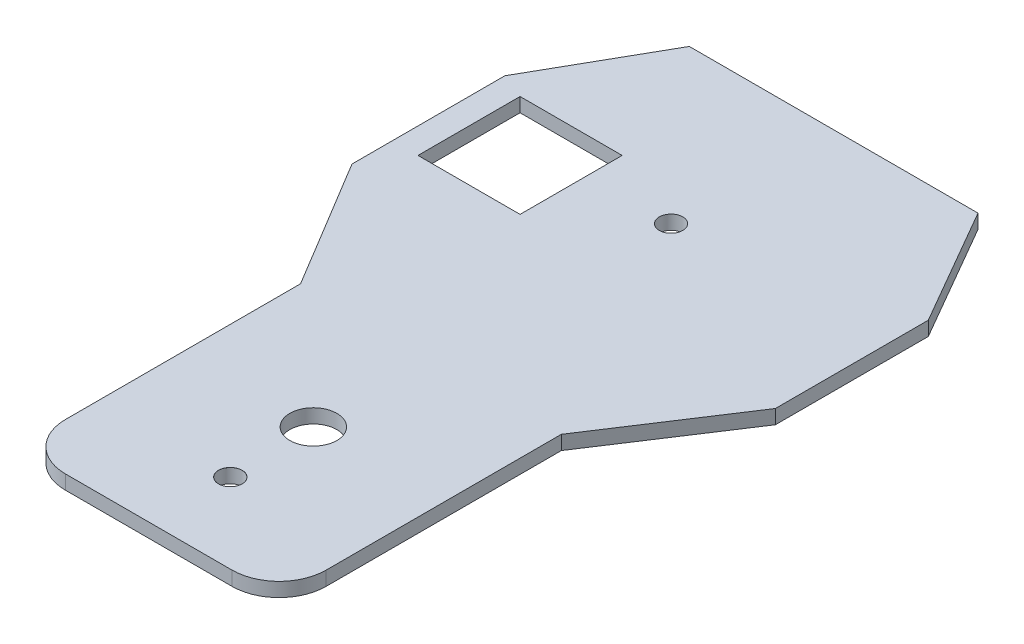
ISO-10303-21;
HEADER;
FILE_DESCRIPTION(('STEP AP214'),'2;1');
FILE_NAME('part.step','',(''),(''),'','','');
FILE_SCHEMA(('AUTOMOTIVE_DESIGN { 1 0 10303 214 1 1 1 1 }'));
ENDSEC;
DATA;
#1=APPLICATION_CONTEXT('core data for automotive mechanical design processes');
#2=APPLICATION_PROTOCOL_DEFINITION('international standard','automotive_design',2000,#1);
#3=PRODUCT_CONTEXT('',#1,'mechanical');
#4=PRODUCT('Part','Part','',(#3));
#5=PRODUCT_RELATED_PRODUCT_CATEGORY('part','',(#4));
#6=PRODUCT_DEFINITION_FORMATION('','',#4);
#7=PRODUCT_DEFINITION_CONTEXT('part definition',#1,'design');
#8=PRODUCT_DEFINITION('design','',#6,#7);
#9=PRODUCT_DEFINITION_SHAPE('','',#8);
#10=(LENGTH_UNIT() NAMED_UNIT(*) SI_UNIT(.MILLI.,.METRE.));
#11=(NAMED_UNIT(*) PLANE_ANGLE_UNIT() SI_UNIT($,.RADIAN.));
#12=(NAMED_UNIT(*) SI_UNIT($,.STERADIAN.) SOLID_ANGLE_UNIT());
#13=UNCERTAINTY_MEASURE_WITH_UNIT(LENGTH_MEASURE(1.E-05),#10,'distance_accuracy_value','');
#14=(GEOMETRIC_REPRESENTATION_CONTEXT(3) GLOBAL_UNCERTAINTY_ASSIGNED_CONTEXT((#13)) GLOBAL_UNIT_ASSIGNED_CONTEXT((#10,
#11,#12)) REPRESENTATION_CONTEXT('',''));
#15=CARTESIAN_POINT('',(0.,0.,0.));
#16=DIRECTION('',(0.,0.,1.));
#17=DIRECTION('',(1.,0.,0.));
#18=AXIS2_PLACEMENT_3D('',#15,#16,#17);
#19=CARTESIAN_POINT('',(113.507776729368,-94.9367989636439,-162.936798963645));
#20=DIRECTION('',(-0.86602540378444,0.,0.499999999999999));
#21=DIRECTION('',(0.499999999999998,0.,0.86602540378444));
#22=AXIS2_PLACEMENT_3D('',#19,#20,#21);
#23=PLANE('',#22);
#24=DIRECTION('',(-0.499999999999998,0.,-0.86602540378444));
#25=VECTOR('',#24,1.);
#26=CARTESIAN_POINT('',(113.507776729368,-100.936798963644,-162.936798963645));
#27=LINE('',#26,#25);
#28=CARTESIAN_POINT('',(142.37529018885,-100.936798963644,-112.936798963645));
#29=VERTEX_POINT('',#28);
#30=CARTESIAN_POINT('',(113.507776729368,-100.936798963644,-162.936798963645));
#31=VERTEX_POINT('',#30);
#32=EDGE_CURVE('E183',#29,#31,#27,.T.);
#33=ORIENTED_EDGE('',*,*,#32,.T.);
#34=DIRECTION('',(0.,-1.,0.));
#35=VECTOR('',#34,1.);
#36=CARTESIAN_POINT('',(113.507776729368,-94.9367989636439,-162.936798963645));
#37=LINE('',#36,#35);
#38=CARTESIAN_POINT('',(113.507776729368,-94.9367989636439,-162.936798963645));
#39=VERTEX_POINT('',#38);
#40=EDGE_CURVE('E203',#39,#31,#37,.T.);
#41=ORIENTED_EDGE('',*,*,#40,.F.);
#42=DIRECTION('',(-0.499999999999998,0.,-0.86602540378444));
#43=VECTOR('',#42,1.);
#44=CARTESIAN_POINT('',(113.507776729368,-94.9367989636439,-162.936798963645));
#45=LINE('',#44,#43);
#46=CARTESIAN_POINT('',(142.37529018885,-94.9367989636443,-112.936798963645));
#47=VERTEX_POINT('',#46);
#48=EDGE_CURVE('E230',#47,#39,#45,.T.);
#49=ORIENTED_EDGE('',*,*,#48,.F.);
#50=DIRECTION('',(0.,-1.,0.));
#51=VECTOR('',#50,1.);
#52=CARTESIAN_POINT('',(142.37529018885,-94.9367989636443,-112.936798963645));
#53=LINE('',#52,#51);
#54=EDGE_CURVE('E224',#47,#29,#53,.T.);
#55=ORIENTED_EDGE('',*,*,#54,.T.);
#56=EDGE_LOOP('',(#33,#41,#49,#55));
#57=FACE_BOUND('',#56,.T.);
#58=ADVANCED_FACE('F38',(#57),#23,.F.);
#59=CARTESIAN_POINT('',(-9.21949599790414,-94.9367989636439,-162.936798963645));
#60=DIRECTION('',(0.,0.,1.));
#61=DIRECTION('',(0.,-1.,0.));
#62=AXIS2_PLACEMENT_3D('',#59,#60,#61);
#63=PLANE('',#62);
#64=DIRECTION('',(-1.,0.,0.));
#65=VECTOR('',#64,1.);
#66=CARTESIAN_POINT('',(-9.21949599790414,-100.936798963644,-162.936798963645));
#67=LINE('',#66,#65);
#68=CARTESIAN_POINT('',(-9.21949599790414,-100.936798963644,-162.936798963645));
#69=VERTEX_POINT('',#68);
#70=EDGE_CURVE('E246',#31,#69,#67,.T.);
#71=ORIENTED_EDGE('',*,*,#70,.T.);
#72=DIRECTION('',(0.,-1.,0.));
#73=VECTOR('',#72,1.);
#74=CARTESIAN_POINT('',(-9.21949599790414,-94.9367989636439,-162.936798963645));
#75=LINE('',#74,#73);
#76=CARTESIAN_POINT('',(-9.21949599790414,-94.9367989636439,-162.936798963645));
#77=VERTEX_POINT('',#76);
#78=EDGE_CURVE('E206',#77,#69,#75,.T.);
#79=ORIENTED_EDGE('',*,*,#78,.F.);
#80=DIRECTION('',(-1.,0.,0.));
#81=VECTOR('',#80,1.);
#82=CARTESIAN_POINT('',(-9.21949599790414,-94.9367989636439,-162.936798963645));
#83=LINE('',#82,#81);
#84=EDGE_CURVE('E266',#39,#77,#83,.T.);
#85=ORIENTED_EDGE('',*,*,#84,.F.);
#86=ORIENTED_EDGE('',*,*,#40,.T.);
#87=EDGE_LOOP('',(#71,#79,#85,#86));
#88=FACE_BOUND('',#87,.T.);
#89=ADVANCED_FACE('F323',(#88),#63,.F.);
#90=CARTESIAN_POINT('',(-9.21949599790414,-94.9367989636439,-162.936798963645));
#91=DIRECTION('',(0.86948551479421,0.,0.493958439104999));
#92=DIRECTION('',(0.493958439104999,0.,-0.86948551479421));
#93=AXIS2_PLACEMENT_3D('',#90,#91,#92);
#94=PLANE('',#93);
#95=DIRECTION('',(-0.493958439104999,0.,0.86948551479421));
#96=VECTOR('',#95,1.);
#97=CARTESIAN_POINT('',(-9.21949599790414,-100.936798963644,-162.936798963645));
#98=LINE('',#97,#96);
#99=CARTESIAN_POINT('',(-37.6247098111503,-100.936798963644,-112.936798963645));
#100=VERTEX_POINT('',#99);
#101=EDGE_CURVE('E244',#69,#100,#98,.T.);
#102=ORIENTED_EDGE('',*,*,#101,.T.);
#103=DIRECTION('',(0.,-1.,0.));
#104=VECTOR('',#103,1.);
#105=CARTESIAN_POINT('',(-37.6247098111503,-94.9367989636443,-112.936798963645));
#106=LINE('',#105,#104);
#107=CARTESIAN_POINT('',(-37.6247098111503,-94.9367989636443,-112.936798963645));
#108=VERTEX_POINT('',#107);
#109=EDGE_CURVE('E209',#108,#100,#106,.T.);
#110=ORIENTED_EDGE('',*,*,#109,.F.);
#111=DIRECTION('',(-0.493958439104999,0.,0.86948551479421));
#112=VECTOR('',#111,1.);
#113=CARTESIAN_POINT('',(-9.21949599790414,-94.9367989636439,-162.936798963645));
#114=LINE('',#113,#112);
#115=EDGE_CURVE('E264',#77,#108,#114,.T.);
#116=ORIENTED_EDGE('',*,*,#115,.F.);
#117=ORIENTED_EDGE('',*,*,#78,.T.);
#118=EDGE_LOOP('',(#102,#110,#116,#117));
#119=FACE_BOUND('',#118,.T.);
#120=ADVANCED_FACE('F329',(#119),#94,.F.);
#121=CARTESIAN_POINT('',(-37.6247098111503,-94.9367989636443,-112.936798963645));
#122=DIRECTION('',(1.,0.,0.));
#123=DIRECTION('',(0.,0.,-1.));
#124=AXIS2_PLACEMENT_3D('',#121,#122,#123);
#125=PLANE('',#124);
#126=DIRECTION('',(0.,0.,1.));
#127=VECTOR('',#126,1.);
#128=CARTESIAN_POINT('',(-37.6247098111503,-100.936798963644,-112.936798963645));
#129=LINE('',#128,#127);
#130=CARTESIAN_POINT('',(-37.6247098111503,-100.936798963645,-47.9367989636454));
#131=VERTEX_POINT('',#130);
#132=EDGE_CURVE('E242',#100,#131,#129,.T.);
#133=ORIENTED_EDGE('',*,*,#132,.T.);
#134=DIRECTION('',(0.,-1.,0.));
#135=VECTOR('',#134,1.);
#136=CARTESIAN_POINT('',(-37.6247098111503,-94.936798963645,-47.9367989636454));
#137=LINE('',#136,#135);
#138=CARTESIAN_POINT('',(-37.6247098111503,-94.936798963645,-47.9367989636454));
#139=VERTEX_POINT('',#138);
#140=EDGE_CURVE('E212',#139,#131,#137,.T.);
#141=ORIENTED_EDGE('',*,*,#140,.F.);
#142=DIRECTION('',(0.,0.,1.));
#143=VECTOR('',#142,1.);
#144=CARTESIAN_POINT('',(-37.6247098111503,-94.9367989636443,-112.936798963645));
#145=LINE('',#144,#143);
#146=EDGE_CURVE('E262',#108,#139,#145,.T.);
#147=ORIENTED_EDGE('',*,*,#146,.F.);
#148=ORIENTED_EDGE('',*,*,#109,.T.);
#149=EDGE_LOOP('',(#133,#141,#147,#148));
#150=FACE_BOUND('',#149,.T.);
#151=ADVANCED_FACE('F373',(#150),#125,.F.);
#152=CARTESIAN_POINT('',(-37.6247098111503,-94.936798963645,-47.9367989636454));
#153=DIRECTION('',(0.856483287792819,0.,-0.516174755031282));
#154=DIRECTION('',(-0.516174755031282,0.,-0.856483287792819));
#155=AXIS2_PLACEMENT_3D('',#152,#153,#154);
#156=PLANE('',#155);
#157=DIRECTION('',(0.516174755031281,0.,0.856483287792819));
#158=VECTOR('',#157,1.);
#159=CARTESIAN_POINT('',(-37.6247098111503,-100.936798963645,-47.9367989636454));
#160=LINE('',#159,#158);
#161=CARTESIAN_POINT('',(-4.47799004282734,-100.936798963646,7.06320103635456));
#162=VERTEX_POINT('',#161);
#163=EDGE_CURVE('E240',#131,#162,#160,.T.);
#164=ORIENTED_EDGE('',*,*,#163,.T.);
#165=DIRECTION('',(0.,-1.,0.));
#166=VECTOR('',#165,1.);
#167=CARTESIAN_POINT('',(-4.47799004282734,-94.9367989636456,7.06320103635463));
#168=LINE('',#167,#166);
#169=CARTESIAN_POINT('',(-4.47799004282734,-94.9367989636456,7.06320103635463));
#170=VERTEX_POINT('',#169);
#171=EDGE_CURVE('E215',#170,#162,#168,.T.);
#172=ORIENTED_EDGE('',*,*,#171,.F.);
#173=DIRECTION('',(0.516174755031281,0.,0.856483287792819));
#174=VECTOR('',#173,1.);
#175=CARTESIAN_POINT('',(-37.6247098111503,-94.936798963645,-47.9367989636454));
#176=LINE('',#175,#174);
#177=EDGE_CURVE('E260',#139,#170,#176,.T.);
#178=ORIENTED_EDGE('',*,*,#177,.F.);
#179=ORIENTED_EDGE('',*,*,#140,.T.);
#180=EDGE_LOOP('',(#164,#172,#178,#179));
#181=FACE_BOUND('',#180,.T.);
#182=ADVANCED_FACE('F378',(#181),#156,.F.);
#183=CARTESIAN_POINT('',(-4.47799004282734,-94.9367989636456,7.06320103635463));
#184=DIRECTION('',(1.,0.,0.));
#185=DIRECTION('',(0.,0.,-1.));
#186=AXIS2_PLACEMENT_3D('',#183,#184,#185);
#187=PLANE('',#186);
#188=DIRECTION('',(0.,0.,1.));
#189=VECTOR('',#188,1.);
#190=CARTESIAN_POINT('',(-4.47799004282734,-100.936798963646,7.06320103635456));
#191=LINE('',#190,#189);
#192=CARTESIAN_POINT('',(-4.47799004282733,-100.936798963647,107.063201036355));
#193=VERTEX_POINT('',#192);
#194=EDGE_CURVE('E237',#162,#193,#191,.T.);
#195=ORIENTED_EDGE('',*,*,#194,.T.);
#196=DIRECTION('',(0.,-1.,0.));
#197=VECTOR('',#196,1.);
#198=CARTESIAN_POINT('',(-4.47799004282733,-94.9367989636466,107.063201036355));
#199=LINE('',#198,#197);
#200=CARTESIAN_POINT('',(-4.47799004282733,-94.9367989636466,107.063201036355));
#201=VERTEX_POINT('',#200);
#202=EDGE_CURVE('E185',#193,#201,#199,.F.);
#203=ORIENTED_EDGE('',*,*,#202,.T.);
#204=DIRECTION('',(0.,0.,1.));
#205=VECTOR('',#204,1.);
#206=CARTESIAN_POINT('',(-4.47799004282734,-94.9367989636456,7.06320103635463));
#207=LINE('',#206,#205);
#208=EDGE_CURVE('E257',#170,#201,#207,.T.);
#209=ORIENTED_EDGE('',*,*,#208,.F.);
#210=ORIENTED_EDGE('',*,*,#171,.T.);
#211=EDGE_LOOP('',(#195,#203,#209,#210));
#212=FACE_BOUND('',#211,.T.);
#213=ADVANCED_FACE('F389',(#212),#187,.F.);
#214=CARTESIAN_POINT('',(-4.47799004282733,-94.9367989636469,127.063201036355));
#215=DIRECTION('',(0.,0.,-1.));
#216=DIRECTION('',(0.,1.,0.));
#217=AXIS2_PLACEMENT_3D('',#214,#215,#216);
#218=PLANE('',#217);
#219=DIRECTION('',(1.,0.,0.));
#220=VECTOR('',#219,1.);
#221=CARTESIAN_POINT('',(-4.47799004282733,-94.9367989636469,127.063201036355));
#222=LINE('',#221,#220);
#223=CARTESIAN_POINT('',(15.5220099571727,-94.9367989636469,127.063201036355));
#224=VERTEX_POINT('',#223);
#225=CARTESIAN_POINT('',(86.3815704693818,-94.9367989636469,127.063201036355));
#226=VERTEX_POINT('',#225);
#227=EDGE_CURVE('E255',#224,#226,#222,.T.);
#228=ORIENTED_EDGE('',*,*,#227,.F.);
#229=DIRECTION('',(0.,-1.,0.));
#230=VECTOR('',#229,1.);
#231=CARTESIAN_POINT('',(15.5220099571727,-94.9367989636469,127.063201036355));
#232=LINE('',#231,#230);
#233=CARTESIAN_POINT('',(15.5220099571727,-100.936798963647,127.063201036355));
#234=VERTEX_POINT('',#233);
#235=EDGE_CURVE('E189',#224,#234,#232,.T.);
#236=ORIENTED_EDGE('',*,*,#235,.T.);
#237=DIRECTION('',(1.,0.,0.));
#238=VECTOR('',#237,1.);
#239=CARTESIAN_POINT('',(-4.47799004282733,-100.936798963647,127.063201036355));
#240=LINE('',#239,#238);
#241=CARTESIAN_POINT('',(86.3815704693818,-100.936798963647,127.063201036355));
#242=VERTEX_POINT('',#241);
#243=EDGE_CURVE('E235',#234,#242,#240,.T.);
#244=ORIENTED_EDGE('',*,*,#243,.T.);
#245=DIRECTION('',(0.,-1.,0.));
#246=VECTOR('',#245,1.);
#247=CARTESIAN_POINT('',(86.3815704693818,-94.9367989636469,127.063201036355));
#248=LINE('',#247,#246);
#249=EDGE_CURVE('E194',#242,#226,#248,.F.);
#250=ORIENTED_EDGE('',*,*,#249,.T.);
#251=EDGE_LOOP('',(#228,#236,#244,#250));
#252=FACE_BOUND('',#251,.T.);
#253=ADVANCED_FACE('F386',(#252),#218,.F.);
#254=CARTESIAN_POINT('',(106.381570469382,-94.9367989636456,7.06320103635463));
#255=DIRECTION('',(-1.,0.,0.));
#256=DIRECTION('',(0.,1.,0.));
#257=AXIS2_PLACEMENT_3D('',#254,#255,#256);
#258=PLANE('',#257);
#259=DIRECTION('',(0.,0.,-1.));
#260=VECTOR('',#259,1.);
#261=CARTESIAN_POINT('',(106.381570469382,-94.9367989636456,7.06320103635463));
#262=LINE('',#261,#260);
#263=CARTESIAN_POINT('',(106.381570469382,-94.9367989636466,107.063201036355));
#264=VERTEX_POINT('',#263);
#265=CARTESIAN_POINT('',(106.381570469382,-94.9367989636456,7.06320103635463));
#266=VERTEX_POINT('',#265);
#267=EDGE_CURVE('E253',#264,#266,#262,.T.);
#268=ORIENTED_EDGE('',*,*,#267,.F.);
#269=DIRECTION('',(0.,-1.,0.));
#270=VECTOR('',#269,1.);
#271=CARTESIAN_POINT('',(106.381570469382,-94.9367989636466,107.063201036355));
#272=LINE('',#271,#270);
#273=CARTESIAN_POINT('',(106.381570469382,-100.936798963647,107.063201036355));
#274=VERTEX_POINT('',#273);
#275=EDGE_CURVE('E200',#264,#274,#272,.T.);
#276=ORIENTED_EDGE('',*,*,#275,.T.);
#277=DIRECTION('',(0.,0.,-1.));
#278=VECTOR('',#277,1.);
#279=CARTESIAN_POINT('',(106.381570469382,-100.936798963646,7.06320103635456));
#280=LINE('',#279,#278);
#281=CARTESIAN_POINT('',(106.381570469382,-100.936798963646,7.06320103635456));
#282=VERTEX_POINT('',#281);
#283=EDGE_CURVE('E233',#274,#282,#280,.T.);
#284=ORIENTED_EDGE('',*,*,#283,.T.);
#285=DIRECTION('',(0.,-1.,0.));
#286=VECTOR('',#285,1.);
#287=CARTESIAN_POINT('',(106.381570469382,-94.9367989636456,7.06320103635463));
#288=LINE('',#287,#286);
#289=EDGE_CURVE('E218',#266,#282,#288,.T.);
#290=ORIENTED_EDGE('',*,*,#289,.F.);
#291=EDGE_LOOP('',(#268,#276,#284,#290));
#292=FACE_BOUND('',#291,.T.);
#293=ADVANCED_FACE('F350',(#292),#258,.F.);
#294=CARTESIAN_POINT('',(106.381570469382,-94.9367989636456,7.06320103635463));
#295=DIRECTION('',(-0.836745295712563,0.,-0.547592284553841));
#296=DIRECTION('',(-0.547592284553841,0.,0.836745295712564));
#297=AXIS2_PLACEMENT_3D('',#294,#295,#296);
#298=PLANE('',#297);
#299=DIRECTION('',(0.547592284553841,0.,-0.836745295712564));
#300=VECTOR('',#299,1.);
#301=CARTESIAN_POINT('',(106.381570469382,-100.936798963646,7.06320103635456));
#302=LINE('',#301,#300);
#303=CARTESIAN_POINT('',(142.37529018885,-100.936798963645,-47.9367989636454));
#304=VERTEX_POINT('',#303);
#305=EDGE_CURVE('E231',#282,#304,#302,.T.);
#306=ORIENTED_EDGE('',*,*,#305,.T.);
#307=DIRECTION('',(0.,-1.,0.));
#308=VECTOR('',#307,1.);
#309=CARTESIAN_POINT('',(142.37529018885,-94.936798963645,-47.9367989636454));
#310=LINE('',#309,#308);
#311=CARTESIAN_POINT('',(142.37529018885,-94.936798963645,-47.9367989636454));
#312=VERTEX_POINT('',#311);
#313=EDGE_CURVE('E221',#312,#304,#310,.T.);
#314=ORIENTED_EDGE('',*,*,#313,.F.);
#315=DIRECTION('',(0.547592284553841,0.,-0.836745295712564));
#316=VECTOR('',#315,1.);
#317=CARTESIAN_POINT('',(106.381570469382,-94.9367989636456,7.06320103635463));
#318=LINE('',#317,#316);
#319=EDGE_CURVE('E251',#266,#312,#318,.T.);
#320=ORIENTED_EDGE('',*,*,#319,.F.);
#321=ORIENTED_EDGE('',*,*,#289,.T.);
#322=EDGE_LOOP('',(#306,#314,#320,#321));
#323=FACE_BOUND('',#322,.T.);
#324=ADVANCED_FACE('F356',(#323),#298,.F.);
#325=CARTESIAN_POINT('',(142.37529018885,-94.9367989636443,-112.936798963645));
#326=DIRECTION('',(-1.,0.,0.));
#327=DIRECTION('',(0.,1.,0.));
#328=AXIS2_PLACEMENT_3D('',#325,#326,#327);
#329=PLANE('',#328);
#330=DIRECTION('',(0.,0.,-1.));
#331=VECTOR('',#330,1.);
#332=CARTESIAN_POINT('',(142.37529018885,-100.936798963644,-112.936798963645));
#333=LINE('',#332,#331);
#334=EDGE_CURVE('E228',#304,#29,#333,.T.);
#335=ORIENTED_EDGE('',*,*,#334,.T.);
#336=ORIENTED_EDGE('',*,*,#54,.F.);
#337=DIRECTION('',(0.,0.,-1.));
#338=VECTOR('',#337,1.);
#339=CARTESIAN_POINT('',(142.37529018885,-94.9367989636443,-112.936798963645));
#340=LINE('',#339,#338);
#341=EDGE_CURVE('E227',#312,#47,#340,.T.);
#342=ORIENTED_EDGE('',*,*,#341,.F.);
#343=ORIENTED_EDGE('',*,*,#313,.T.);
#344=EDGE_LOOP('',(#335,#336,#342,#343));
#345=FACE_BOUND('',#344,.T.);
#346=ADVANCED_FACE('F341',(#345),#329,.F.);
#347=CARTESIAN_POINT('',(52.1441403657322,-94.9367989636439,-162.936798963645));
#348=DIRECTION('',(0.,1.,0.));
#349=DIRECTION('',(1.,0.,0.));
#350=AXIS2_PLACEMENT_3D('',#347,#348,#349);
#351=PLANE('',#350);
#352=DIRECTION('',(0.,0.,1.));
#353=VECTOR('',#352,1.);
#354=CARTESIAN_POINT('',(-26.7629275982652,-94.9367989636439,-162.936798963645));
#355=LINE('',#354,#353);
#356=CARTESIAN_POINT('',(-26.7629275982652,-94.9367989636444,-108.526541805227));
#357=VERTEX_POINT('',#356);
#358=CARTESIAN_POINT('',(-26.7629275982652,-94.9367989636449,-65.1265418052271));
#359=VERTEX_POINT('',#358);
#360=EDGE_CURVE('E160',#357,#359,#355,.T.);
#361=ORIENTED_EDGE('',*,*,#360,.F.);
#362=DIRECTION('',(-1.,0.,0.));
#363=VECTOR('',#362,1.);
#364=CARTESIAN_POINT('',(52.1441403657322,-94.9367989636444,-108.526541805227));
#365=LINE('',#364,#363);
#366=CARTESIAN_POINT('',(16.6370724017348,-94.9367989636446,-108.526541805227));
#367=VERTEX_POINT('',#366);
#368=EDGE_CURVE('E280',#367,#357,#365,.T.);
#369=ORIENTED_EDGE('',*,*,#368,.F.);
#370=DIRECTION('',(0.,0.,-1.));
#371=VECTOR('',#370,1.);
#372=CARTESIAN_POINT('',(16.6370724017348,-94.9367989636439,-162.936798963645));
#373=LINE('',#372,#371);
#374=CARTESIAN_POINT('',(16.6370724017348,-94.9367989636449,-65.1265418052271));
#375=VERTEX_POINT('',#374);
#376=EDGE_CURVE('E282',#375,#367,#373,.T.);
#377=ORIENTED_EDGE('',*,*,#376,.F.);
#378=DIRECTION('',(1.,0.,0.));
#379=VECTOR('',#378,1.);
#380=CARTESIAN_POINT('',(52.1441403657322,-94.9367989636449,-65.1265418052271));
#381=LINE('',#380,#379);
#382=EDGE_CURVE('E284',#359,#375,#381,.T.);
#383=ORIENTED_EDGE('',*,*,#382,.F.);
#384=EDGE_LOOP('',(#361,#369,#377,#383));
#385=FACE_BOUND('',#384,.T.);
#386=CARTESIAN_POINT('',(51.7613958672676,-94.9367989636465,93.1780732426967));
#387=DIRECTION('',(0.,1.,0.));
#388=DIRECTION('',(0.,0.,1.));
#389=AXIS2_PLACEMENT_3D('',#386,#387,#388);
#390=CIRCLE('',#389,5.025);
#391=CARTESIAN_POINT('',(51.7613958672676,-94.9367989636465,98.2030732426967));
#392=VERTEX_POINT('',#391);
#393=EDGE_CURVE('E276',#392,#392,#390,.T.);
#394=ORIENTED_EDGE('',*,*,#393,.F.);
#395=EDGE_LOOP('',(#394));
#396=FACE_BOUND('',#395,.T.);
#397=CARTESIAN_POINT('',(52.1441403657322,-94.9367989636445,-93.8031524494841));
#398=DIRECTION('',(0.,1.,0.));
#399=DIRECTION('',(1.,0.,0.));
#400=AXIS2_PLACEMENT_3D('',#397,#398,#399);
#401=CIRCLE('',#400,5.);
#402=CARTESIAN_POINT('',(57.1441403657322,-94.9367989636445,-93.8031524494841));
#403=VERTEX_POINT('',#402);
#404=EDGE_CURVE('E174',#403,#403,#401,.T.);
#405=ORIENTED_EDGE('',*,*,#404,.F.);
#406=EDGE_LOOP('',(#405));
#407=FACE_BOUND('',#406,.T.);
#408=CARTESIAN_POINT('',(50.9517902132772,-94.9367989636461,57.0632010363546));
#409=DIRECTION('',(0.,1.,0.));
#410=DIRECTION('',(1.,0.,0.));
#411=AXIS2_PLACEMENT_3D('',#408,#409,#410);
#412=CIRCLE('',#411,10.);
#413=CARTESIAN_POINT('',(60.9517902132772,-94.9367989636461,57.0632010363546));
#414=VERTEX_POINT('',#413);
#415=EDGE_CURVE('E179',#414,#414,#412,.T.);
#416=ORIENTED_EDGE('',*,*,#415,.F.);
#417=EDGE_LOOP('',(#416));
#418=FACE_BOUND('',#417,.T.);
#419=ORIENTED_EDGE('',*,*,#208,.T.);
#420=CARTESIAN_POINT('',(15.5220099571727,-94.9367989636466,107.063201036355));
#421=DIRECTION('',(0.,1.,0.));
#422=DIRECTION('',(1.,0.,0.));
#423=AXIS2_PLACEMENT_3D('',#420,#421,#422);
#424=CIRCLE('',#423,20.);
#425=EDGE_CURVE('E153',#201,#224,#424,.T.);
#426=ORIENTED_EDGE('',*,*,#425,.T.);
#427=ORIENTED_EDGE('',*,*,#227,.T.);
#428=CARTESIAN_POINT('',(86.3815704693818,-94.9367989636466,107.063201036355));
#429=DIRECTION('',(0.,1.,0.));
#430=DIRECTION('',(1.,0.,0.));
#431=AXIS2_PLACEMENT_3D('',#428,#429,#430);
#432=CIRCLE('',#431,20.);
#433=EDGE_CURVE('E192',#226,#264,#432,.T.);
#434=ORIENTED_EDGE('',*,*,#433,.T.);
#435=ORIENTED_EDGE('',*,*,#267,.T.);
#436=ORIENTED_EDGE('',*,*,#319,.T.);
#437=ORIENTED_EDGE('',*,*,#341,.T.);
#438=ORIENTED_EDGE('',*,*,#48,.T.);
#439=ORIENTED_EDGE('',*,*,#84,.T.);
#440=ORIENTED_EDGE('',*,*,#115,.T.);
#441=ORIENTED_EDGE('',*,*,#146,.T.);
#442=ORIENTED_EDGE('',*,*,#177,.T.);
#443=EDGE_LOOP('',(#419,#426,#427,#434,#435,#436,#437,#438,#439,#440,#441,#442));
#444=FACE_BOUND('',#443,.T.);
#445=ADVANCED_FACE('F292',(#385,#396,#407,#418,#444),#351,.T.);
#446=CARTESIAN_POINT('',(86.3815704693818,-94.9367989636466,107.063201036355));
#447=DIRECTION('',(0.,-1.,0.));
#448=DIRECTION('',(-1.,0.,0.));
#449=AXIS2_PLACEMENT_3D('',#446,#447,#448);
#450=CYLINDRICAL_SURFACE('',#449,20.);
#451=ORIENTED_EDGE('',*,*,#433,.F.);
#452=ORIENTED_EDGE('',*,*,#249,.F.);
#453=CARTESIAN_POINT('',(86.3815704693818,-100.936798963647,107.063201036355));
#454=DIRECTION('',(0.,1.,0.));
#455=DIRECTION('',(1.,0.,0.));
#456=AXIS2_PLACEMENT_3D('',#453,#454,#455);
#457=CIRCLE('',#456,20.);
#458=EDGE_CURVE('E197',#274,#242,#457,.F.);
#459=ORIENTED_EDGE('',*,*,#458,.F.);
#460=ORIENTED_EDGE('',*,*,#275,.F.);
#461=EDGE_LOOP('',(#451,#452,#459,#460));
#462=FACE_BOUND('',#461,.T.);
#463=ADVANCED_FACE('F333',(#462),#450,.T.);
#464=CARTESIAN_POINT('',(15.5220099571727,-94.9367989636466,107.063201036355));
#465=DIRECTION('',(0.,-1.,0.));
#466=DIRECTION('',(-1.,0.,0.));
#467=AXIS2_PLACEMENT_3D('',#464,#465,#466);
#468=CYLINDRICAL_SURFACE('',#467,20.);
#469=ORIENTED_EDGE('',*,*,#425,.F.);
#470=ORIENTED_EDGE('',*,*,#202,.F.);
#471=CARTESIAN_POINT('',(15.5220099571727,-100.936798963647,107.063201036355));
#472=DIRECTION('',(0.,1.,0.));
#473=DIRECTION('',(1.,0.,0.));
#474=AXIS2_PLACEMENT_3D('',#471,#472,#473);
#475=CIRCLE('',#474,20.);
#476=EDGE_CURVE('E187',#234,#193,#475,.F.);
#477=ORIENTED_EDGE('',*,*,#476,.F.);
#478=ORIENTED_EDGE('',*,*,#235,.F.);
#479=EDGE_LOOP('',(#469,#470,#477,#478));
#480=FACE_BOUND('',#479,.T.);
#481=ADVANCED_FACE('F40',(#480),#468,.T.);
#482=CARTESIAN_POINT('',(50.9517902132772,-94.9367989636461,57.0632010363546));
#483=DIRECTION('',(0.,-1.,0.));
#484=DIRECTION('',(-1.,0.,0.));
#485=AXIS2_PLACEMENT_3D('',#482,#483,#484);
#486=CYLINDRICAL_SURFACE('',#485,10.);
#487=ORIENTED_EDGE('',*,*,#415,.T.);
#488=EDGE_LOOP('',(#487));
#489=FACE_BOUND('',#488,.T.);
#490=CARTESIAN_POINT('',(50.9517902132772,-100.936798963646,57.0632010363546));
#491=DIRECTION('',(0.,1.,0.));
#492=DIRECTION('',(1.,0.,0.));
#493=AXIS2_PLACEMENT_3D('',#490,#491,#492);
#494=CIRCLE('',#493,10.);
#495=CARTESIAN_POINT('',(60.9517902132772,-100.936798963646,57.0632010363546));
#496=VERTEX_POINT('',#495);
#497=EDGE_CURVE('E180',#496,#496,#494,.F.);
#498=ORIENTED_EDGE('',*,*,#497,.T.);
#499=EDGE_LOOP('',(#498));
#500=FACE_BOUND('',#499,.T.);
#501=ADVANCED_FACE('F317',(#489,#500),#486,.F.);
#502=CARTESIAN_POINT('',(52.1441403657322,-104.936798963645,-93.8031524494842));
#503=DIRECTION('',(0.,1.,0.));
#504=DIRECTION('',(1.,0.,0.));
#505=AXIS2_PLACEMENT_3D('',#502,#503,#504);
#506=CYLINDRICAL_SURFACE('',#505,5.);
#507=ORIENTED_EDGE('',*,*,#404,.T.);
#508=EDGE_LOOP('',(#507));
#509=FACE_BOUND('',#508,.T.);
#510=CARTESIAN_POINT('',(52.1441403657322,-100.936798963645,-93.8031524494841));
#511=DIRECTION('',(0.,1.,0.));
#512=DIRECTION('',(1.,0.,0.));
#513=AXIS2_PLACEMENT_3D('',#510,#511,#512);
#514=CIRCLE('',#513,5.);
#515=CARTESIAN_POINT('',(57.1441403657322,-100.936798963645,-93.8031524494841));
#516=VERTEX_POINT('',#515);
#517=EDGE_CURVE('E176',#516,#516,#514,.T.);
#518=ORIENTED_EDGE('',*,*,#517,.F.);
#519=EDGE_LOOP('',(#518));
#520=FACE_BOUND('',#519,.T.);
#521=ADVANCED_FACE('F309',(#509,#520),#506,.F.);
#522=CARTESIAN_POINT('',(52.1441403657322,-100.936798963644,-162.936798963645));
#523=DIRECTION('',(0.,1.,0.));
#524=DIRECTION('',(1.,0.,0.));
#525=AXIS2_PLACEMENT_3D('',#522,#523,#524);
#526=PLANE('',#525);
#527=DIRECTION('',(-1.,0.,0.));
#528=VECTOR('',#527,1.);
#529=CARTESIAN_POINT('',(52.1441403657322,-100.936798963644,-108.526541805227));
#530=LINE('',#529,#528);
#531=CARTESIAN_POINT('',(16.6370724017348,-100.936798963645,-108.526541805227));
#532=VERTEX_POINT('',#531);
#533=CARTESIAN_POINT('',(-26.7629275982652,-100.936798963644,-108.526541805227));
#534=VERTEX_POINT('',#533);
#535=EDGE_CURVE('E46',#532,#534,#530,.T.);
#536=ORIENTED_EDGE('',*,*,#535,.T.);
#537=DIRECTION('',(0.,0.,1.));
#538=VECTOR('',#537,1.);
#539=CARTESIAN_POINT('',(-26.7629275982652,-100.936798963644,-162.936798963645));
#540=LINE('',#539,#538);
#541=CARTESIAN_POINT('',(-26.7629275982651,-100.936798963645,-65.1265418052271));
#542=VERTEX_POINT('',#541);
#543=EDGE_CURVE('E12',#534,#542,#540,.T.);
#544=ORIENTED_EDGE('',*,*,#543,.T.);
#545=DIRECTION('',(1.,0.,0.));
#546=VECTOR('',#545,1.);
#547=CARTESIAN_POINT('',(52.1441403657322,-100.936798963645,-65.1265418052271));
#548=LINE('',#547,#546);
#549=CARTESIAN_POINT('',(16.6370724017348,-100.936798963645,-65.1265418052271));
#550=VERTEX_POINT('',#549);
#551=EDGE_CURVE('E148',#542,#550,#548,.T.);
#552=ORIENTED_EDGE('',*,*,#551,.T.);
#553=DIRECTION('',(0.,0.,-1.));
#554=VECTOR('',#553,1.);
#555=CARTESIAN_POINT('',(16.6370724017348,-100.936798963644,-162.936798963645));
#556=LINE('',#555,#554);
#557=EDGE_CURVE('E152',#550,#532,#556,.T.);
#558=ORIENTED_EDGE('',*,*,#557,.T.);
#559=EDGE_LOOP('',(#536,#544,#552,#558));
#560=FACE_BOUND('',#559,.T.);
#561=CARTESIAN_POINT('',(51.7613958672676,-100.936798963646,93.1780732426966));
#562=DIRECTION('',(0.,1.,0.));
#563=DIRECTION('',(0.,0.,1.));
#564=AXIS2_PLACEMENT_3D('',#561,#562,#563);
#565=CIRCLE('',#564,4.99999999999999);
#566=CARTESIAN_POINT('',(51.7613958672676,-100.936798963647,98.1780732426966));
#567=VERTEX_POINT('',#566);
#568=EDGE_CURVE('E171',#567,#567,#565,.T.);
#569=ORIENTED_EDGE('',*,*,#568,.T.);
#570=EDGE_LOOP('',(#569));
#571=FACE_BOUND('',#570,.T.);
#572=ORIENTED_EDGE('',*,*,#517,.T.);
#573=EDGE_LOOP('',(#572));
#574=FACE_BOUND('',#573,.T.);
#575=ORIENTED_EDGE('',*,*,#497,.F.);
#576=EDGE_LOOP('',(#575));
#577=FACE_BOUND('',#576,.T.);
#578=ORIENTED_EDGE('',*,*,#243,.F.);
#579=ORIENTED_EDGE('',*,*,#476,.T.);
#580=ORIENTED_EDGE('',*,*,#194,.F.);
#581=ORIENTED_EDGE('',*,*,#163,.F.);
#582=ORIENTED_EDGE('',*,*,#132,.F.);
#583=ORIENTED_EDGE('',*,*,#101,.F.);
#584=ORIENTED_EDGE('',*,*,#70,.F.);
#585=ORIENTED_EDGE('',*,*,#32,.F.);
#586=ORIENTED_EDGE('',*,*,#334,.F.);
#587=ORIENTED_EDGE('',*,*,#305,.F.);
#588=ORIENTED_EDGE('',*,*,#283,.F.);
#589=ORIENTED_EDGE('',*,*,#458,.T.);
#590=EDGE_LOOP('',(#578,#579,#580,#581,#582,#583,#584,#585,#586,#587,#588,#589));
#591=FACE_BOUND('',#590,.T.);
#592=ADVANCED_FACE('F164',(#560,#571,#574,#577,#591),#526,.F.);
#593=CARTESIAN_POINT('',(51.7613958672676,-94.9367989636465,93.1780732426967));
#594=DIRECTION('',(0.,1.,0.));
#595=DIRECTION('',(0.,0.,1.));
#596=AXIS2_PLACEMENT_3D('',#593,#594,#595);
#597=CYLINDRICAL_SURFACE('',#596,4.99999999999999);
#598=CARTESIAN_POINT('',(51.7613958672676,-94.9617989636465,93.1780732426967));
#599=DIRECTION('',(0.,1.,0.));
#600=DIRECTION('',(0.,0.,1.));
#601=AXIS2_PLACEMENT_3D('',#598,#599,#600);
#602=CIRCLE('',#601,4.99999999999999);
#603=CARTESIAN_POINT('',(51.7613958672676,-94.9617989636466,98.1780732426967));
#604=VERTEX_POINT('',#603);
#605=EDGE_CURVE('E175',#604,#604,#602,.T.);
#606=ORIENTED_EDGE('',*,*,#605,.T.);
#607=EDGE_LOOP('',(#606));
#608=FACE_BOUND('',#607,.T.);
#609=ORIENTED_EDGE('',*,*,#568,.F.);
#610=EDGE_LOOP('',(#609));
#611=FACE_BOUND('',#610,.T.);
#612=ADVANCED_FACE('F308',(#608,#611),#597,.F.);
#613=CARTESIAN_POINT('',(51.7613958672676,-94.9367989636465,93.1780732426967));
#614=DIRECTION('',(0.,1.,0.));
#615=DIRECTION('',(0.,0.,1.));
#616=AXIS2_PLACEMENT_3D('',#613,#614,#615);
#617=CONICAL_SURFACE('',#616,5.025,0.785398163397448);
#618=ORIENTED_EDGE('',*,*,#605,.F.);
#619=EDGE_LOOP('',(#618));
#620=FACE_BOUND('',#619,.T.);
#621=ORIENTED_EDGE('',*,*,#393,.T.);
#622=EDGE_LOOP('',(#621));
#623=FACE_BOUND('',#622,.T.);
#624=ADVANCED_FACE('F305',(#620,#623),#617,.F.);
#625=CARTESIAN_POINT('',(-26.7629275982652,-200.,-108.526541805227));
#626=DIRECTION('',(-1.,0.,0.));
#627=DIRECTION('',(0.,0.,1.));
#628=AXIS2_PLACEMENT_3D('',#625,#626,#627);
#629=PLANE('',#628);
#630=ORIENTED_EDGE('',*,*,#360,.T.);
#631=DIRECTION('',(0.,1.,0.));
#632=VECTOR('',#631,1.);
#633=CARTESIAN_POINT('',(-26.7629275982651,-200.,-65.1265418052271));
#634=LINE('',#633,#632);
#635=EDGE_CURVE('E53',#542,#359,#634,.T.);
#636=ORIENTED_EDGE('',*,*,#635,.F.);
#637=ORIENTED_EDGE('',*,*,#543,.F.);
#638=DIRECTION('',(0.,1.,0.));
#639=VECTOR('',#638,1.);
#640=CARTESIAN_POINT('',(-26.7629275982652,-200.,-108.526541805227));
#641=LINE('',#640,#639);
#642=EDGE_CURVE('E285',#534,#357,#641,.T.);
#643=ORIENTED_EDGE('',*,*,#642,.T.);
#644=EDGE_LOOP('',(#630,#636,#637,#643));
#645=FACE_BOUND('',#644,.T.);
#646=ADVANCED_FACE('F156',(#645),#629,.F.);
#647=CARTESIAN_POINT('',(-26.7629275982652,-200.,-108.526541805227));
#648=DIRECTION('',(0.,0.,-1.));
#649=DIRECTION('',(-1.,0.,0.));
#650=AXIS2_PLACEMENT_3D('',#647,#648,#649);
#651=PLANE('',#650);
#652=ORIENTED_EDGE('',*,*,#368,.T.);
#653=ORIENTED_EDGE('',*,*,#642,.F.);
#654=ORIENTED_EDGE('',*,*,#535,.F.);
#655=DIRECTION('',(0.,1.,0.));
#656=VECTOR('',#655,1.);
#657=CARTESIAN_POINT('',(16.6370724017348,-200.,-108.526541805227));
#658=LINE('',#657,#656);
#659=EDGE_CURVE('E288',#532,#367,#658,.T.);
#660=ORIENTED_EDGE('',*,*,#659,.T.);
#661=EDGE_LOOP('',(#652,#653,#654,#660));
#662=FACE_BOUND('',#661,.T.);
#663=ADVANCED_FACE('F297',(#662),#651,.F.);
#664=CARTESIAN_POINT('',(16.6370724017348,-200.,-65.1265418052271));
#665=DIRECTION('',(1.,0.,0.));
#666=DIRECTION('',(0.,0.,-1.));
#667=AXIS2_PLACEMENT_3D('',#664,#665,#666);
#668=PLANE('',#667);
#669=ORIENTED_EDGE('',*,*,#376,.T.);
#670=ORIENTED_EDGE('',*,*,#659,.F.);
#671=ORIENTED_EDGE('',*,*,#557,.F.);
#672=DIRECTION('',(0.,1.,0.));
#673=VECTOR('',#672,1.);
#674=CARTESIAN_POINT('',(16.6370724017348,-200.,-65.1265418052271));
#675=LINE('',#674,#673);
#676=EDGE_CURVE('E58',#550,#375,#675,.T.);
#677=ORIENTED_EDGE('',*,*,#676,.T.);
#678=EDGE_LOOP('',(#669,#670,#671,#677));
#679=FACE_BOUND('',#678,.T.);
#680=ADVANCED_FACE('F296',(#679),#668,.F.);
#681=CARTESIAN_POINT('',(-26.7629275982651,-200.,-65.1265418052271));
#682=DIRECTION('',(0.,0.,1.));
#683=DIRECTION('',(1.,0.,0.));
#684=AXIS2_PLACEMENT_3D('',#681,#682,#683);
#685=PLANE('',#684);
#686=ORIENTED_EDGE('',*,*,#382,.T.);
#687=ORIENTED_EDGE('',*,*,#676,.F.);
#688=ORIENTED_EDGE('',*,*,#551,.F.);
#689=ORIENTED_EDGE('',*,*,#635,.T.);
#690=EDGE_LOOP('',(#686,#687,#688,#689));
#691=FACE_BOUND('',#690,.T.);
#692=ADVANCED_FACE('F149',(#691),#685,.F.);
#693=CLOSED_SHELL('',(#58,#89,#120,#151,#182,#213,#253,#293,#324,#346,#445,#463,#481,#501,#521,
#592,#612,#624,#646,#663,#680,#692));
#694=MANIFOLD_SOLID_BREP('B2',#693);
#695=ADVANCED_BREP_SHAPE_REPRESENTATION('',(#18,#694),#14);
#696=SHAPE_DEFINITION_REPRESENTATION(#9,#695);
ENDSEC;
END-ISO-10303-21;
